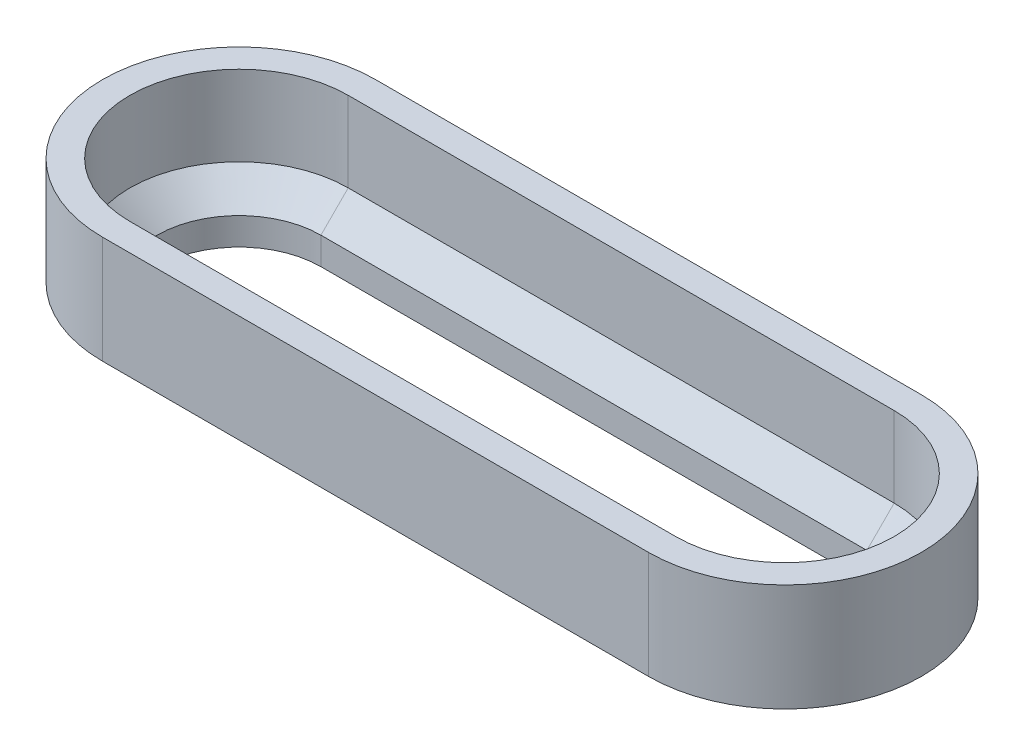
ISO-10303-21;
HEADER;
FILE_DESCRIPTION(('STEP AP214'),'2;1');
FILE_NAME('part.step','',(''),(''),'','','');
FILE_SCHEMA(('AUTOMOTIVE_DESIGN { 1 0 10303 214 1 1 1 1 }'));
ENDSEC;
DATA;
#1=APPLICATION_CONTEXT('core data for automotive mechanical design processes');
#2=APPLICATION_PROTOCOL_DEFINITION('international standard','automotive_design',2000,#1);
#3=PRODUCT_CONTEXT('',#1,'mechanical');
#4=PRODUCT('Part','Part','',(#3));
#5=PRODUCT_RELATED_PRODUCT_CATEGORY('part','',(#4));
#6=PRODUCT_DEFINITION_FORMATION('','',#4);
#7=PRODUCT_DEFINITION_CONTEXT('part definition',#1,'design');
#8=PRODUCT_DEFINITION('design','',#6,#7);
#9=PRODUCT_DEFINITION_SHAPE('','',#8);
#10=(LENGTH_UNIT() NAMED_UNIT(*) SI_UNIT(.MILLI.,.METRE.));
#11=(NAMED_UNIT(*) PLANE_ANGLE_UNIT() SI_UNIT($,.RADIAN.));
#12=(NAMED_UNIT(*) SI_UNIT($,.STERADIAN.) SOLID_ANGLE_UNIT());
#13=UNCERTAINTY_MEASURE_WITH_UNIT(LENGTH_MEASURE(1.E-05),#10,'distance_accuracy_value','');
#14=(GEOMETRIC_REPRESENTATION_CONTEXT(3) GLOBAL_UNCERTAINTY_ASSIGNED_CONTEXT((#13)) GLOBAL_UNIT_ASSIGNED_CONTEXT((#10,
#11,#12)) REPRESENTATION_CONTEXT('',''));
#15=CARTESIAN_POINT('',(0.,0.,0.));
#16=DIRECTION('',(0.,0.,1.));
#17=DIRECTION('',(1.,0.,0.));
#18=AXIS2_PLACEMENT_3D('',#15,#16,#17);
#19=CARTESIAN_POINT('',(-25.4,10.,0.));
#20=DIRECTION('',(0.,-1.,0.));
#21=DIRECTION('',(0.,0.,-1.));
#22=AXIS2_PLACEMENT_3D('',#19,#20,#21);
#23=CYLINDRICAL_SURFACE('',#22,10.16);
#24=DIRECTION('',(0.,-1.,0.));
#25=VECTOR('',#24,1.);
#26=CARTESIAN_POINT('',(-25.4,10.,10.16));
#27=LINE('',#26,#25);
#28=CARTESIAN_POINT('',(-25.4,10.,10.16));
#29=VERTEX_POINT('',#28);
#30=CARTESIAN_POINT('',(-25.4,2.54,10.16));
#31=VERTEX_POINT('',#30);
#32=EDGE_CURVE('E224',#29,#31,#27,.T.);
#33=ORIENTED_EDGE('',*,*,#32,.T.);
#34=CARTESIAN_POINT('',(-25.4,2.54,0.));
#35=DIRECTION('',(0.,-1.,0.));
#36=DIRECTION('',(0.,0.,-1.));
#37=AXIS2_PLACEMENT_3D('',#34,#35,#36);
#38=CIRCLE('',#37,10.16);
#39=CARTESIAN_POINT('',(-25.4,2.54,-10.16));
#40=VERTEX_POINT('',#39);
#41=EDGE_CURVE('E195',#31,#40,#38,.T.);
#42=ORIENTED_EDGE('',*,*,#41,.T.);
#43=DIRECTION('',(0.,-1.,0.));
#44=VECTOR('',#43,1.);
#45=CARTESIAN_POINT('',(-25.4,10.,-10.16));
#46=LINE('',#45,#44);
#47=CARTESIAN_POINT('',(-25.4,10.,-10.16));
#48=VERTEX_POINT('',#47);
#49=EDGE_CURVE('E210',#48,#40,#46,.T.);
#50=ORIENTED_EDGE('',*,*,#49,.F.);
#51=CARTESIAN_POINT('',(-25.4,10.,0.));
#52=DIRECTION('',(0.,1.,0.));
#53=DIRECTION('',(0.,0.,1.));
#54=AXIS2_PLACEMENT_3D('',#51,#52,#53);
#55=CIRCLE('',#54,10.16);
#56=EDGE_CURVE('E200',#48,#29,#55,.T.);
#57=ORIENTED_EDGE('',*,*,#56,.T.);
#58=EDGE_LOOP('',(#33,#42,#50,#57));
#59=FACE_BOUND('',#58,.T.);
#60=ADVANCED_FACE('F41',(#59),#23,.F.);
#61=CARTESIAN_POINT('',(-25.4,10.,10.16));
#62=DIRECTION('',(0.,0.,-1.));
#63=DIRECTION('',(-1.,0.,0.));
#64=AXIS2_PLACEMENT_3D('',#61,#62,#63);
#65=PLANE('',#64);
#66=DIRECTION('',(0.,-1.,0.));
#67=VECTOR('',#66,1.);
#68=CARTESIAN_POINT('',(25.4,10.,10.16));
#69=LINE('',#68,#67);
#70=CARTESIAN_POINT('',(25.4,10.,10.16));
#71=VERTEX_POINT('',#70);
#72=CARTESIAN_POINT('',(25.4,2.54,10.16));
#73=VERTEX_POINT('',#72);
#74=EDGE_CURVE('E221',#71,#73,#69,.T.);
#75=ORIENTED_EDGE('',*,*,#74,.T.);
#76=DIRECTION('',(-1.,0.,0.));
#77=VECTOR('',#76,1.);
#78=CARTESIAN_POINT('',(25.4,2.54,10.16));
#79=LINE('',#78,#77);
#80=EDGE_CURVE('E192',#73,#31,#79,.T.);
#81=ORIENTED_EDGE('',*,*,#80,.T.);
#82=ORIENTED_EDGE('',*,*,#32,.F.);
#83=DIRECTION('',(1.,0.,0.));
#84=VECTOR('',#83,1.);
#85=CARTESIAN_POINT('',(-25.4,10.,10.16));
#86=LINE('',#85,#84);
#87=EDGE_CURVE('E202',#29,#71,#86,.T.);
#88=ORIENTED_EDGE('',*,*,#87,.T.);
#89=EDGE_LOOP('',(#75,#81,#82,#88));
#90=FACE_BOUND('',#89,.T.);
#91=ADVANCED_FACE('F289',(#90),#65,.T.);
#92=CARTESIAN_POINT('',(25.4,10.,0.));
#93=DIRECTION('',(0.,-1.,0.));
#94=DIRECTION('',(0.,0.,-1.));
#95=AXIS2_PLACEMENT_3D('',#92,#93,#94);
#96=CYLINDRICAL_SURFACE('',#95,10.16);
#97=DIRECTION('',(0.,-1.,0.));
#98=VECTOR('',#97,1.);
#99=CARTESIAN_POINT('',(25.4,10.,-10.16));
#100=LINE('',#99,#98);
#101=CARTESIAN_POINT('',(25.4,10.,-10.16));
#102=VERTEX_POINT('',#101);
#103=CARTESIAN_POINT('',(25.4,2.54,-10.16));
#104=VERTEX_POINT('',#103);
#105=EDGE_CURVE('E218',#102,#104,#100,.T.);
#106=ORIENTED_EDGE('',*,*,#105,.T.);
#107=CARTESIAN_POINT('',(25.4,2.54,0.));
#108=DIRECTION('',(0.,-1.,0.));
#109=DIRECTION('',(0.,0.,-1.));
#110=AXIS2_PLACEMENT_3D('',#107,#108,#109);
#111=CIRCLE('',#110,10.16);
#112=EDGE_CURVE('E187',#104,#73,#111,.T.);
#113=ORIENTED_EDGE('',*,*,#112,.T.);
#114=ORIENTED_EDGE('',*,*,#74,.F.);
#115=CARTESIAN_POINT('',(25.4,10.,0.));
#116=DIRECTION('',(0.,1.,0.));
#117=DIRECTION('',(0.,0.,1.));
#118=AXIS2_PLACEMENT_3D('',#115,#116,#117);
#119=CIRCLE('',#118,10.16);
#120=EDGE_CURVE('E205',#71,#102,#119,.T.);
#121=ORIENTED_EDGE('',*,*,#120,.T.);
#122=EDGE_LOOP('',(#106,#113,#114,#121));
#123=FACE_BOUND('',#122,.T.);
#124=ADVANCED_FACE('F300',(#123),#96,.F.);
#125=CARTESIAN_POINT('',(-25.4,10.,-10.16));
#126=DIRECTION('',(0.,0.,1.));
#127=DIRECTION('',(1.,0.,0.));
#128=AXIS2_PLACEMENT_3D('',#125,#126,#127);
#129=PLANE('',#128);
#130=ORIENTED_EDGE('',*,*,#49,.T.);
#131=DIRECTION('',(1.,0.,0.));
#132=VECTOR('',#131,1.);
#133=CARTESIAN_POINT('',(-25.4,2.54,-10.16));
#134=LINE('',#133,#132);
#135=EDGE_CURVE('E197',#40,#104,#134,.T.);
#136=ORIENTED_EDGE('',*,*,#135,.T.);
#137=ORIENTED_EDGE('',*,*,#105,.F.);
#138=DIRECTION('',(-1.,0.,0.));
#139=VECTOR('',#138,1.);
#140=CARTESIAN_POINT('',(-25.4,10.,-10.16));
#141=LINE('',#140,#139);
#142=EDGE_CURVE('E208',#102,#48,#141,.T.);
#143=ORIENTED_EDGE('',*,*,#142,.T.);
#144=EDGE_LOOP('',(#130,#136,#137,#143));
#145=FACE_BOUND('',#144,.T.);
#146=ADVANCED_FACE('F302',(#145),#129,.T.);
#147=CARTESIAN_POINT('',(-25.4,10.,0.));
#148=DIRECTION('',(0.,1.,0.));
#149=DIRECTION('',(0.,0.,1.));
#150=AXIS2_PLACEMENT_3D('',#147,#148,#149);
#151=PLANE('',#150);
#152=CARTESIAN_POINT('',(-25.4,10.,0.));
#153=DIRECTION('',(0.,1.,0.));
#154=DIRECTION('',(0.,0.,1.));
#155=AXIS2_PLACEMENT_3D('',#152,#153,#154);
#156=CIRCLE('',#155,12.7);
#157=CARTESIAN_POINT('',(-25.4,10.,-12.7));
#158=VERTEX_POINT('',#157);
#159=CARTESIAN_POINT('',(-25.4,10.,12.7));
#160=VERTEX_POINT('',#159);
#161=EDGE_CURVE('E228',#158,#160,#156,.T.);
#162=ORIENTED_EDGE('',*,*,#161,.T.);
#163=DIRECTION('',(1.,0.,0.));
#164=VECTOR('',#163,1.);
#165=CARTESIAN_POINT('',(-25.4,10.,12.7));
#166=LINE('',#165,#164);
#167=CARTESIAN_POINT('',(25.4,10.,12.7));
#168=VERTEX_POINT('',#167);
#169=EDGE_CURVE('E231',#160,#168,#166,.T.);
#170=ORIENTED_EDGE('',*,*,#169,.T.);
#171=CARTESIAN_POINT('',(25.4,10.,0.));
#172=DIRECTION('',(0.,1.,0.));
#173=DIRECTION('',(0.,0.,1.));
#174=AXIS2_PLACEMENT_3D('',#171,#172,#173);
#175=CIRCLE('',#174,12.7);
#176=CARTESIAN_POINT('',(25.4,10.,-12.7));
#177=VERTEX_POINT('',#176);
#178=EDGE_CURVE('E234',#168,#177,#175,.T.);
#179=ORIENTED_EDGE('',*,*,#178,.T.);
#180=DIRECTION('',(-1.,0.,0.));
#181=VECTOR('',#180,1.);
#182=CARTESIAN_POINT('',(-25.4,10.,-12.7));
#183=LINE('',#182,#181);
#184=EDGE_CURVE('E236',#177,#158,#183,.T.);
#185=ORIENTED_EDGE('',*,*,#184,.T.);
#186=EDGE_LOOP('',(#162,#170,#179,#185));
#187=FACE_BOUND('',#186,.T.);
#188=ORIENTED_EDGE('',*,*,#87,.F.);
#189=ORIENTED_EDGE('',*,*,#56,.F.);
#190=ORIENTED_EDGE('',*,*,#142,.F.);
#191=ORIENTED_EDGE('',*,*,#120,.F.);
#192=EDGE_LOOP('',(#188,#189,#190,#191));
#193=FACE_BOUND('',#192,.T.);
#194=ADVANCED_FACE('F297',(#187,#193),#151,.T.);
#195=CARTESIAN_POINT('',(-25.4,0.,0.));
#196=DIRECTION('',(0.,1.,0.));
#197=DIRECTION('',(0.,0.,1.));
#198=AXIS2_PLACEMENT_3D('',#195,#196,#197);
#199=PLANE('',#198);
#200=CARTESIAN_POINT('',(-25.4,0.,0.));
#201=DIRECTION('',(0.,1.,0.));
#202=DIRECTION('',(0.,0.,1.));
#203=AXIS2_PLACEMENT_3D('',#200,#201,#202);
#204=CIRCLE('',#203,12.7);
#205=CARTESIAN_POINT('',(-25.4,0.,-12.7));
#206=VERTEX_POINT('',#205);
#207=CARTESIAN_POINT('',(-25.4,0.,12.7));
#208=VERTEX_POINT('',#207);
#209=EDGE_CURVE('E227',#206,#208,#204,.T.);
#210=ORIENTED_EDGE('',*,*,#209,.F.);
#211=DIRECTION('',(-1.,0.,0.));
#212=VECTOR('',#211,1.);
#213=CARTESIAN_POINT('',(-25.4,0.,-12.7));
#214=LINE('',#213,#212);
#215=CARTESIAN_POINT('',(25.4,0.,-12.7));
#216=VERTEX_POINT('',#215);
#217=EDGE_CURVE('E232',#216,#206,#214,.T.);
#218=ORIENTED_EDGE('',*,*,#217,.F.);
#219=CARTESIAN_POINT('',(25.4,0.,0.));
#220=DIRECTION('',(0.,1.,0.));
#221=DIRECTION('',(0.,0.,1.));
#222=AXIS2_PLACEMENT_3D('',#219,#220,#221);
#223=CIRCLE('',#222,12.7);
#224=CARTESIAN_POINT('',(25.4,0.,12.7));
#225=VERTEX_POINT('',#224);
#226=EDGE_CURVE('E243',#225,#216,#223,.T.);
#227=ORIENTED_EDGE('',*,*,#226,.F.);
#228=DIRECTION('',(1.,0.,0.));
#229=VECTOR('',#228,1.);
#230=CARTESIAN_POINT('',(-25.4,0.,12.7));
#231=LINE('',#230,#229);
#232=EDGE_CURVE('E241',#208,#225,#231,.T.);
#233=ORIENTED_EDGE('',*,*,#232,.F.);
#234=EDGE_LOOP('',(#210,#218,#227,#233));
#235=FACE_BOUND('',#234,.T.);
#236=CARTESIAN_POINT('',(-25.4,0.,0.));
#237=DIRECTION('',(0.,1.,0.));
#238=DIRECTION('',(0.,0.,1.));
#239=AXIS2_PLACEMENT_3D('',#236,#237,#238);
#240=CIRCLE('',#239,10.16);
#241=CARTESIAN_POINT('',(-25.4,0.,-10.16));
#242=VERTEX_POINT('',#241);
#243=CARTESIAN_POINT('',(-25.4,0.,10.16));
#244=VERTEX_POINT('',#243);
#245=EDGE_CURVE('E199',#242,#244,#240,.T.);
#246=ORIENTED_EDGE('',*,*,#245,.T.);
#247=DIRECTION('',(1.,0.,0.));
#248=VECTOR('',#247,1.);
#249=CARTESIAN_POINT('',(-25.4,0.,10.16));
#250=LINE('',#249,#248);
#251=CARTESIAN_POINT('',(25.4,0.,10.16));
#252=VERTEX_POINT('',#251);
#253=EDGE_CURVE('E212',#244,#252,#250,.T.);
#254=ORIENTED_EDGE('',*,*,#253,.T.);
#255=CARTESIAN_POINT('',(25.4,0.,0.));
#256=DIRECTION('',(0.,1.,0.));
#257=DIRECTION('',(0.,0.,1.));
#258=AXIS2_PLACEMENT_3D('',#255,#256,#257);
#259=CIRCLE('',#258,10.16);
#260=CARTESIAN_POINT('',(25.4,0.,-10.16));
#261=VERTEX_POINT('',#260);
#262=EDGE_CURVE('E150',#252,#261,#259,.T.);
#263=ORIENTED_EDGE('',*,*,#262,.T.);
#264=DIRECTION('',(-1.,0.,0.));
#265=VECTOR('',#264,1.);
#266=CARTESIAN_POINT('',(-25.4,0.,-10.16));
#267=LINE('',#266,#265);
#268=EDGE_CURVE('E203',#261,#242,#267,.T.);
#269=ORIENTED_EDGE('',*,*,#268,.T.);
#270=EDGE_LOOP('',(#246,#254,#263,#269));
#271=FACE_BOUND('',#270,.T.);
#272=ADVANCED_FACE('F310',(#235,#271),#199,.F.);
#273=CARTESIAN_POINT('',(-25.4,10.,0.));
#274=DIRECTION('',(0.,-1.,0.));
#275=DIRECTION('',(0.,0.,-1.));
#276=AXIS2_PLACEMENT_3D('',#273,#274,#275);
#277=CYLINDRICAL_SURFACE('',#276,12.7);
#278=ORIENTED_EDGE('',*,*,#209,.T.);
#279=DIRECTION('',(0.,-1.,0.));
#280=VECTOR('',#279,1.);
#281=CARTESIAN_POINT('',(-25.4,10.,12.7));
#282=LINE('',#281,#280);
#283=EDGE_CURVE('E254',#160,#208,#282,.T.);
#284=ORIENTED_EDGE('',*,*,#283,.F.);
#285=ORIENTED_EDGE('',*,*,#161,.F.);
#286=DIRECTION('',(0.,-1.,0.));
#287=VECTOR('',#286,1.);
#288=CARTESIAN_POINT('',(-25.4,10.,-12.7));
#289=LINE('',#288,#287);
#290=EDGE_CURVE('E238',#158,#206,#289,.T.);
#291=ORIENTED_EDGE('',*,*,#290,.T.);
#292=EDGE_LOOP('',(#278,#284,#285,#291));
#293=FACE_BOUND('',#292,.T.);
#294=ADVANCED_FACE('F324',(#293),#277,.T.);
#295=CARTESIAN_POINT('',(-25.4,10.,12.7));
#296=DIRECTION('',(0.,0.,-1.));
#297=DIRECTION('',(-1.,0.,0.));
#298=AXIS2_PLACEMENT_3D('',#295,#296,#297);
#299=PLANE('',#298);
#300=ORIENTED_EDGE('',*,*,#232,.T.);
#301=DIRECTION('',(0.,-1.,0.));
#302=VECTOR('',#301,1.);
#303=CARTESIAN_POINT('',(25.4,10.,12.7));
#304=LINE('',#303,#302);
#305=EDGE_CURVE('E251',#168,#225,#304,.T.);
#306=ORIENTED_EDGE('',*,*,#305,.F.);
#307=ORIENTED_EDGE('',*,*,#169,.F.);
#308=ORIENTED_EDGE('',*,*,#283,.T.);
#309=EDGE_LOOP('',(#300,#306,#307,#308));
#310=FACE_BOUND('',#309,.T.);
#311=ADVANCED_FACE('F332',(#310),#299,.F.);
#312=CARTESIAN_POINT('',(25.4,10.,0.));
#313=DIRECTION('',(0.,-1.,0.));
#314=DIRECTION('',(0.,0.,-1.));
#315=AXIS2_PLACEMENT_3D('',#312,#313,#314);
#316=CYLINDRICAL_SURFACE('',#315,12.7);
#317=ORIENTED_EDGE('',*,*,#226,.T.);
#318=DIRECTION('',(0.,-1.,0.));
#319=VECTOR('',#318,1.);
#320=CARTESIAN_POINT('',(25.4,10.,-12.7));
#321=LINE('',#320,#319);
#322=EDGE_CURVE('E248',#177,#216,#321,.T.);
#323=ORIENTED_EDGE('',*,*,#322,.F.);
#324=ORIENTED_EDGE('',*,*,#178,.F.);
#325=ORIENTED_EDGE('',*,*,#305,.T.);
#326=EDGE_LOOP('',(#317,#323,#324,#325));
#327=FACE_BOUND('',#326,.T.);
#328=ADVANCED_FACE('F328',(#327),#316,.T.);
#329=CARTESIAN_POINT('',(-25.4,10.,-12.7));
#330=DIRECTION('',(0.,0.,1.));
#331=DIRECTION('',(1.,0.,0.));
#332=AXIS2_PLACEMENT_3D('',#329,#330,#331);
#333=PLANE('',#332);
#334=ORIENTED_EDGE('',*,*,#217,.T.);
#335=ORIENTED_EDGE('',*,*,#290,.F.);
#336=ORIENTED_EDGE('',*,*,#184,.F.);
#337=ORIENTED_EDGE('',*,*,#322,.T.);
#338=EDGE_LOOP('',(#334,#335,#336,#337));
#339=FACE_BOUND('',#338,.T.);
#340=ADVANCED_FACE('F326',(#339),#333,.F.);
#341=CARTESIAN_POINT('',(25.4,2.54,0.));
#342=DIRECTION('',(0.,-1.,0.));
#343=DIRECTION('',(0.,0.,-1.));
#344=AXIS2_PLACEMENT_3D('',#341,#342,#343);
#345=CYLINDRICAL_SURFACE('',#344,7.62000000000001);
#346=DIRECTION('',(0.,-1.,0.));
#347=VECTOR('',#346,1.);
#348=CARTESIAN_POINT('',(25.4,2.54,7.62000000000001));
#349=LINE('',#348,#347);
#350=CARTESIAN_POINT('',(25.4,0.,7.62000000000001));
#351=VERTEX_POINT('',#350);
#352=CARTESIAN_POINT('',(25.4,-2.54,7.62000000000001));
#353=VERTEX_POINT('',#352);
#354=EDGE_CURVE('E168',#351,#353,#349,.T.);
#355=ORIENTED_EDGE('',*,*,#354,.F.);
#356=CARTESIAN_POINT('',(25.4,0.,0.));
#357=DIRECTION('',(0.,-1.,0.));
#358=DIRECTION('',(0.,0.,-1.));
#359=AXIS2_PLACEMENT_3D('',#356,#357,#358);
#360=CIRCLE('',#359,7.62000000000001);
#361=CARTESIAN_POINT('',(25.4,0.,-7.62000000000001));
#362=VERTEX_POINT('',#361);
#363=EDGE_CURVE('E51',#351,#362,#360,.F.);
#364=ORIENTED_EDGE('',*,*,#363,.T.);
#365=DIRECTION('',(0.,-1.,0.));
#366=VECTOR('',#365,1.);
#367=CARTESIAN_POINT('',(25.4,2.54,-7.62000000000001));
#368=LINE('',#367,#366);
#369=CARTESIAN_POINT('',(25.4,-2.54,-7.62000000000001));
#370=VERTEX_POINT('',#369);
#371=EDGE_CURVE('E176',#362,#370,#368,.T.);
#372=ORIENTED_EDGE('',*,*,#371,.T.);
#373=CARTESIAN_POINT('',(25.4,-2.54,0.));
#374=DIRECTION('',(0.,-1.,0.));
#375=DIRECTION('',(0.,0.,-1.));
#376=AXIS2_PLACEMENT_3D('',#373,#374,#375);
#377=CIRCLE('',#376,7.62000000000001);
#378=EDGE_CURVE('E148',#370,#353,#377,.T.);
#379=ORIENTED_EDGE('',*,*,#378,.T.);
#380=EDGE_LOOP('',(#355,#364,#372,#379));
#381=FACE_BOUND('',#380,.T.);
#382=ADVANCED_FACE('F175',(#381),#345,.F.);
#383=CARTESIAN_POINT('',(-25.4,2.54,-7.61999999999999));
#384=DIRECTION('',(0.,0.,-1.));
#385=DIRECTION('',(-1.,0.,0.));
#386=AXIS2_PLACEMENT_3D('',#383,#384,#385);
#387=PLANE('',#386);
#388=ORIENTED_EDGE('',*,*,#371,.F.);
#389=DIRECTION('',(-1.,0.,0.));
#390=VECTOR('',#389,1.);
#391=CARTESIAN_POINT('',(-25.4,0.,-7.61999999999999));
#392=LINE('',#391,#390);
#393=CARTESIAN_POINT('',(-25.4,0.,-7.61999999999999));
#394=VERTEX_POINT('',#393);
#395=EDGE_CURVE('E11',#362,#394,#392,.T.);
#396=ORIENTED_EDGE('',*,*,#395,.T.);
#397=DIRECTION('',(0.,-1.,0.));
#398=VECTOR('',#397,1.);
#399=CARTESIAN_POINT('',(-25.4,2.54,-7.61999999999999));
#400=LINE('',#399,#398);
#401=CARTESIAN_POINT('',(-25.4,-2.54,-7.61999999999999));
#402=VERTEX_POINT('',#401);
#403=EDGE_CURVE('E188',#394,#402,#400,.T.);
#404=ORIENTED_EDGE('',*,*,#403,.T.);
#405=DIRECTION('',(1.,0.,0.));
#406=VECTOR('',#405,1.);
#407=CARTESIAN_POINT('',(-25.4,-2.54,-7.61999999999999));
#408=LINE('',#407,#406);
#409=EDGE_CURVE('E173',#402,#370,#408,.T.);
#410=ORIENTED_EDGE('',*,*,#409,.T.);
#411=EDGE_LOOP('',(#388,#396,#404,#410));
#412=FACE_BOUND('',#411,.T.);
#413=ADVANCED_FACE('F416',(#412),#387,.F.);
#414=CARTESIAN_POINT('',(-25.4,2.54,0.));
#415=DIRECTION('',(0.,-1.,0.));
#416=DIRECTION('',(0.,0.,-1.));
#417=AXIS2_PLACEMENT_3D('',#414,#415,#416);
#418=CYLINDRICAL_SURFACE('',#417,7.61999999999999);
#419=ORIENTED_EDGE('',*,*,#403,.F.);
#420=CARTESIAN_POINT('',(-25.4,0.,0.));
#421=DIRECTION('',(0.,-1.,0.));
#422=DIRECTION('',(0.,0.,-1.));
#423=AXIS2_PLACEMENT_3D('',#420,#421,#422);
#424=CIRCLE('',#423,7.61999999999999);
#425=CARTESIAN_POINT('',(-25.4,0.,7.61999999999998));
#426=VERTEX_POINT('',#425);
#427=EDGE_CURVE('E258',#394,#426,#424,.F.);
#428=ORIENTED_EDGE('',*,*,#427,.T.);
#429=DIRECTION('',(0.,-1.,0.));
#430=VECTOR('',#429,1.);
#431=CARTESIAN_POINT('',(-25.4,2.54,7.61999999999998));
#432=LINE('',#431,#430);
#433=CARTESIAN_POINT('',(-25.4,-2.54,7.61999999999998));
#434=VERTEX_POINT('',#433);
#435=EDGE_CURVE('E172',#426,#434,#432,.T.);
#436=ORIENTED_EDGE('',*,*,#435,.T.);
#437=CARTESIAN_POINT('',(-25.4,-2.54,0.));
#438=DIRECTION('',(0.,-1.,0.));
#439=DIRECTION('',(0.,0.,-1.));
#440=AXIS2_PLACEMENT_3D('',#437,#438,#439);
#441=CIRCLE('',#440,7.61999999999999);
#442=EDGE_CURVE('E165',#434,#402,#441,.T.);
#443=ORIENTED_EDGE('',*,*,#442,.T.);
#444=EDGE_LOOP('',(#419,#428,#436,#443));
#445=FACE_BOUND('',#444,.T.);
#446=ADVANCED_FACE('F283',(#445),#418,.F.);
#447=CARTESIAN_POINT('',(25.4,2.54,7.62000000000001));
#448=DIRECTION('',(0.,0.,1.));
#449=DIRECTION('',(1.,0.,0.));
#450=AXIS2_PLACEMENT_3D('',#447,#448,#449);
#451=PLANE('',#450);
#452=ORIENTED_EDGE('',*,*,#435,.F.);
#453=DIRECTION('',(1.,0.,0.));
#454=VECTOR('',#453,1.);
#455=CARTESIAN_POINT('',(25.4,0.,7.62000000000001));
#456=LINE('',#455,#454);
#457=EDGE_CURVE('E171',#426,#351,#456,.T.);
#458=ORIENTED_EDGE('',*,*,#457,.T.);
#459=ORIENTED_EDGE('',*,*,#354,.T.);
#460=DIRECTION('',(-1.,0.,0.));
#461=VECTOR('',#460,1.);
#462=CARTESIAN_POINT('',(25.4,-2.54,7.62000000000001));
#463=LINE('',#462,#461);
#464=EDGE_CURVE('E157',#353,#434,#463,.T.);
#465=ORIENTED_EDGE('',*,*,#464,.T.);
#466=EDGE_LOOP('',(#452,#458,#459,#465));
#467=FACE_BOUND('',#466,.T.);
#468=ADVANCED_FACE('F169',(#467),#451,.F.);
#469=CARTESIAN_POINT('',(-25.4,-2.54,0.));
#470=DIRECTION('',(0.,1.,0.));
#471=DIRECTION('',(0.,0.,1.));
#472=AXIS2_PLACEMENT_3D('',#469,#470,#471);
#473=CONICAL_SURFACE('',#472,7.61999999999998,0.785398163397447);
#474=DIRECTION('',(0.,-0.707106781186548,-0.707106781186547));
#475=VECTOR('',#474,1.);
#476=CARTESIAN_POINT('',(-25.4,0.,10.16));
#477=LINE('',#476,#475);
#478=EDGE_CURVE('E161',#244,#434,#477,.T.);
#479=ORIENTED_EDGE('',*,*,#478,.F.);
#480=ORIENTED_EDGE('',*,*,#245,.F.);
#481=DIRECTION('',(0.,0.707106781186548,-0.707106781186547));
#482=VECTOR('',#481,1.);
#483=CARTESIAN_POINT('',(-25.4,-2.54,-7.61999999999999));
#484=LINE('',#483,#482);
#485=EDGE_CURVE('E178',#402,#242,#484,.T.);
#486=ORIENTED_EDGE('',*,*,#485,.F.);
#487=ORIENTED_EDGE('',*,*,#442,.F.);
#488=EDGE_LOOP('',(#479,#480,#486,#487));
#489=FACE_BOUND('',#488,.T.);
#490=ADVANCED_FACE('F357',(#489),#473,.T.);
#491=CARTESIAN_POINT('',(25.4,-2.54,-7.61999999999999));
#492=DIRECTION('',(0.,0.707106781186547,0.707106781186548));
#493=DIRECTION('',(1.,0.,0.));
#494=AXIS2_PLACEMENT_3D('',#491,#492,#493);
#495=PLANE('',#494);
#496=ORIENTED_EDGE('',*,*,#485,.T.);
#497=ORIENTED_EDGE('',*,*,#268,.F.);
#498=DIRECTION('',(0.,0.707106781186548,-0.707106781186547));
#499=VECTOR('',#498,1.);
#500=CARTESIAN_POINT('',(25.4,-2.54,-7.61999999999999));
#501=LINE('',#500,#499);
#502=EDGE_CURVE('E153',#370,#261,#501,.T.);
#503=ORIENTED_EDGE('',*,*,#502,.F.);
#504=ORIENTED_EDGE('',*,*,#409,.F.);
#505=EDGE_LOOP('',(#496,#497,#503,#504));
#506=FACE_BOUND('',#505,.T.);
#507=ADVANCED_FACE('F351',(#506),#495,.F.);
#508=CARTESIAN_POINT('',(25.4,-2.54,7.61999999999999));
#509=DIRECTION('',(0.,0.707106781186547,-0.707106781186548));
#510=DIRECTION('',(-1.,0.,0.));
#511=AXIS2_PLACEMENT_3D('',#508,#509,#510);
#512=PLANE('',#511);
#513=ORIENTED_EDGE('',*,*,#478,.T.);
#514=ORIENTED_EDGE('',*,*,#464,.F.);
#515=DIRECTION('',(0.,-0.707106781186548,-0.707106781186547));
#516=VECTOR('',#515,1.);
#517=CARTESIAN_POINT('',(25.4,0.,10.16));
#518=LINE('',#517,#516);
#519=EDGE_CURVE('E144',#252,#353,#518,.T.);
#520=ORIENTED_EDGE('',*,*,#519,.F.);
#521=ORIENTED_EDGE('',*,*,#253,.F.);
#522=EDGE_LOOP('',(#513,#514,#520,#521));
#523=FACE_BOUND('',#522,.T.);
#524=ADVANCED_FACE('F159',(#523),#512,.F.);
#525=CARTESIAN_POINT('',(25.4,-2.54,0.));
#526=DIRECTION('',(0.,1.,0.));
#527=DIRECTION('',(0.,0.,1.));
#528=AXIS2_PLACEMENT_3D('',#525,#526,#527);
#529=CONICAL_SURFACE('',#528,7.61999999999999,0.785398163397447);
#530=ORIENTED_EDGE('',*,*,#502,.T.);
#531=ORIENTED_EDGE('',*,*,#262,.F.);
#532=ORIENTED_EDGE('',*,*,#519,.T.);
#533=ORIENTED_EDGE('',*,*,#378,.F.);
#534=EDGE_LOOP('',(#530,#531,#532,#533));
#535=FACE_BOUND('',#534,.T.);
#536=ADVANCED_FACE('F146',(#535),#529,.T.);
#537=CARTESIAN_POINT('',(25.4,2.54,-10.16));
#538=DIRECTION('',(0.,-0.707106781186547,-0.707106781186548));
#539=DIRECTION('',(1.,0.,0.));
#540=AXIS2_PLACEMENT_3D('',#537,#538,#539);
#541=PLANE('',#540);
#542=DIRECTION('',(0.,0.707106781186548,-0.707106781186546));
#543=VECTOR('',#542,1.);
#544=CARTESIAN_POINT('',(-25.4,0.,-7.61999999999999));
#545=LINE('',#544,#543);
#546=EDGE_CURVE('E266',#394,#40,#545,.T.);
#547=ORIENTED_EDGE('',*,*,#546,.F.);
#548=ORIENTED_EDGE('',*,*,#395,.F.);
#549=DIRECTION('',(0.,-0.707106781186548,0.707106781186547));
#550=VECTOR('',#549,1.);
#551=CARTESIAN_POINT('',(25.4,2.54,-10.16));
#552=LINE('',#551,#550);
#553=EDGE_CURVE('E46',#104,#362,#552,.T.);
#554=ORIENTED_EDGE('',*,*,#553,.F.);
#555=ORIENTED_EDGE('',*,*,#135,.F.);
#556=EDGE_LOOP('',(#547,#548,#554,#555));
#557=FACE_BOUND('',#556,.T.);
#558=ADVANCED_FACE('F44',(#557),#541,.F.);
#559=CARTESIAN_POINT('',(25.4,2.54,0.));
#560=DIRECTION('',(0.,1.,0.));
#561=DIRECTION('',(0.,0.,1.));
#562=AXIS2_PLACEMENT_3D('',#559,#560,#561);
#563=CONICAL_SURFACE('',#562,10.16,0.785398163397447);
#564=ORIENTED_EDGE('',*,*,#553,.T.);
#565=ORIENTED_EDGE('',*,*,#363,.F.);
#566=DIRECTION('',(0.,-0.707106781186548,-0.707106781186547));
#567=VECTOR('',#566,1.);
#568=CARTESIAN_POINT('',(25.4,2.54,10.16));
#569=LINE('',#568,#567);
#570=EDGE_CURVE('E265',#73,#351,#569,.T.);
#571=ORIENTED_EDGE('',*,*,#570,.F.);
#572=ORIENTED_EDGE('',*,*,#112,.F.);
#573=EDGE_LOOP('',(#564,#565,#571,#572));
#574=FACE_BOUND('',#573,.T.);
#575=ADVANCED_FACE('F276',(#574),#563,.F.);
#576=CARTESIAN_POINT('',(-25.4,2.54,0.));
#577=DIRECTION('',(0.,1.,0.));
#578=DIRECTION('',(0.,0.,1.));
#579=AXIS2_PLACEMENT_3D('',#576,#577,#578);
#580=CONICAL_SURFACE('',#579,10.16,0.785398163397447);
#581=ORIENTED_EDGE('',*,*,#546,.T.);
#582=ORIENTED_EDGE('',*,*,#41,.F.);
#583=DIRECTION('',(0.,0.707106781186548,0.707106781186547));
#584=VECTOR('',#583,1.);
#585=CARTESIAN_POINT('',(-25.4,0.,7.61999999999998));
#586=LINE('',#585,#584);
#587=EDGE_CURVE('E263',#426,#31,#586,.T.);
#588=ORIENTED_EDGE('',*,*,#587,.F.);
#589=ORIENTED_EDGE('',*,*,#427,.F.);
#590=EDGE_LOOP('',(#581,#582,#588,#589));
#591=FACE_BOUND('',#590,.T.);
#592=ADVANCED_FACE('F281',(#591),#580,.F.);
#593=CARTESIAN_POINT('',(25.4,2.54,10.16));
#594=DIRECTION('',(0.,-0.707106781186547,0.707106781186548));
#595=DIRECTION('',(-1.,0.,0.));
#596=AXIS2_PLACEMENT_3D('',#593,#594,#595);
#597=PLANE('',#596);
#598=ORIENTED_EDGE('',*,*,#570,.T.);
#599=ORIENTED_EDGE('',*,*,#457,.F.);
#600=ORIENTED_EDGE('',*,*,#587,.T.);
#601=ORIENTED_EDGE('',*,*,#80,.F.);
#602=EDGE_LOOP('',(#598,#599,#600,#601));
#603=FACE_BOUND('',#602,.T.);
#604=ADVANCED_FACE('F285',(#603),#597,.F.);
#605=CLOSED_SHELL('',(#60,#91,#124,#146,#194,#272,#294,#311,#328,#340,#382,#413,#446,#468,#490,
#507,#524,#536,#558,#575,#592,#604));
#606=MANIFOLD_SOLID_BREP('B2',#605);
#607=ADVANCED_BREP_SHAPE_REPRESENTATION('',(#18,#606),#14);
#608=SHAPE_DEFINITION_REPRESENTATION(#9,#607);
ENDSEC;
END-ISO-10303-21;
